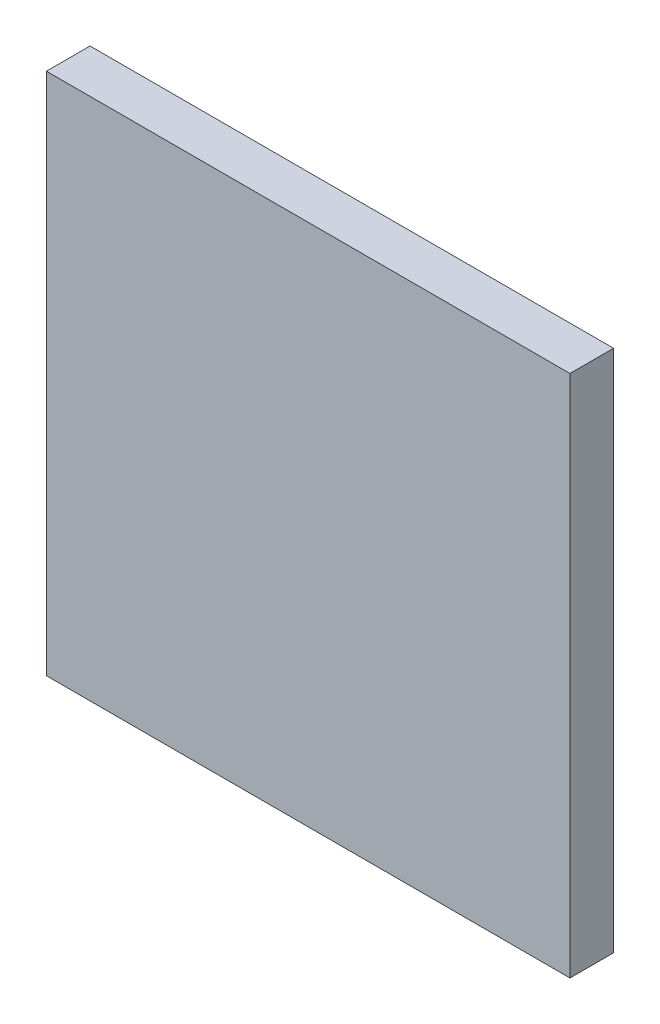
ISO-10303-21;
HEADER;
FILE_DESCRIPTION(('STEP AP214'),'2;1');
FILE_NAME('part.step','',(''),(''),'','','');
FILE_SCHEMA(('AUTOMOTIVE_DESIGN { 1 0 10303 214 1 1 1 1 }'));
ENDSEC;
DATA;
#1=APPLICATION_CONTEXT('core data for automotive mechanical design processes');
#2=APPLICATION_PROTOCOL_DEFINITION('international standard','automotive_design',2000,#1);
#3=PRODUCT_CONTEXT('',#1,'mechanical');
#4=PRODUCT('Part','Part','',(#3));
#5=PRODUCT_RELATED_PRODUCT_CATEGORY('part','',(#4));
#6=PRODUCT_DEFINITION_FORMATION('','',#4);
#7=PRODUCT_DEFINITION_CONTEXT('part definition',#1,'design');
#8=PRODUCT_DEFINITION('design','',#6,#7);
#9=PRODUCT_DEFINITION_SHAPE('','',#8);
#10=(LENGTH_UNIT() NAMED_UNIT(*) SI_UNIT(.MILLI.,.METRE.));
#11=(NAMED_UNIT(*) PLANE_ANGLE_UNIT() SI_UNIT($,.RADIAN.));
#12=(NAMED_UNIT(*) SI_UNIT($,.STERADIAN.) SOLID_ANGLE_UNIT());
#13=UNCERTAINTY_MEASURE_WITH_UNIT(LENGTH_MEASURE(1.E-05),#10,'distance_accuracy_value','');
#14=(GEOMETRIC_REPRESENTATION_CONTEXT(3) GLOBAL_UNCERTAINTY_ASSIGNED_CONTEXT((#13)) GLOBAL_UNIT_ASSIGNED_CONTEXT((#10,
#11,#12)) REPRESENTATION_CONTEXT('',''));
#15=CARTESIAN_POINT('',(0.,0.,0.));
#16=DIRECTION('',(0.,0.,1.));
#17=DIRECTION('',(1.,0.,0.));
#18=AXIS2_PLACEMENT_3D('',#15,#16,#17);
#19=CARTESIAN_POINT('',(-38.1,38.1,6.35));
#20=DIRECTION('',(1.,0.,0.));
#21=DIRECTION('',(0.,0.,-1.));
#22=AXIS2_PLACEMENT_3D('',#19,#20,#21);
#23=PLANE('',#22);
#24=DIRECTION('',(0.,-1.,0.));
#25=VECTOR('',#24,1.);
#26=CARTESIAN_POINT('',(-38.1,38.1,0.));
#27=LINE('',#26,#25);
#28=CARTESIAN_POINT('',(-38.1,38.1,0.));
#29=VERTEX_POINT('',#28);
#30=CARTESIAN_POINT('',(-38.1,-38.1,0.));
#31=VERTEX_POINT('',#30);
#32=EDGE_CURVE('E96',#29,#31,#27,.T.);
#33=ORIENTED_EDGE('',*,*,#32,.T.);
#34=DIRECTION('',(0.,0.,-1.));
#35=VECTOR('',#34,1.);
#36=CARTESIAN_POINT('',(-38.1,-38.1,6.35));
#37=LINE('',#36,#35);
#38=CARTESIAN_POINT('',(-38.1,-38.1,6.35));
#39=VERTEX_POINT('',#38);
#40=EDGE_CURVE('E11',#39,#31,#37,.T.);
#41=ORIENTED_EDGE('',*,*,#40,.F.);
#42=DIRECTION('',(0.,-1.,0.));
#43=VECTOR('',#42,1.);
#44=CARTESIAN_POINT('',(-38.1,38.1,6.35));
#45=LINE('',#44,#43);
#46=CARTESIAN_POINT('',(-38.1,38.1,6.35));
#47=VERTEX_POINT('',#46);
#48=EDGE_CURVE('E84',#47,#39,#45,.T.);
#49=ORIENTED_EDGE('',*,*,#48,.F.);
#50=DIRECTION('',(0.,0.,-1.));
#51=VECTOR('',#50,1.);
#52=CARTESIAN_POINT('',(-38.1,38.1,6.35));
#53=LINE('',#52,#51);
#54=EDGE_CURVE('E92',#47,#29,#53,.T.);
#55=ORIENTED_EDGE('',*,*,#54,.T.);
#56=EDGE_LOOP('',(#33,#41,#49,#55));
#57=FACE_BOUND('',#56,.T.);
#58=ADVANCED_FACE('F33',(#57),#23,.F.);
#59=CARTESIAN_POINT('',(-38.1,-38.1,6.35));
#60=DIRECTION('',(0.,1.,0.));
#61=DIRECTION('',(0.,0.,1.));
#62=AXIS2_PLACEMENT_3D('',#59,#60,#61);
#63=PLANE('',#62);
#64=DIRECTION('',(1.,0.,0.));
#65=VECTOR('',#64,1.);
#66=CARTESIAN_POINT('',(-38.1,-38.1,0.));
#67=LINE('',#66,#65);
#68=CARTESIAN_POINT('',(38.1,-38.1,0.));
#69=VERTEX_POINT('',#68);
#70=EDGE_CURVE('E88',#31,#69,#67,.T.);
#71=ORIENTED_EDGE('',*,*,#70,.T.);
#72=DIRECTION('',(0.,0.,-1.));
#73=VECTOR('',#72,1.);
#74=CARTESIAN_POINT('',(38.1,-38.1,6.35));
#75=LINE('',#74,#73);
#76=CARTESIAN_POINT('',(38.1,-38.1,6.35));
#77=VERTEX_POINT('',#76);
#78=EDGE_CURVE('E41',#77,#69,#75,.T.);
#79=ORIENTED_EDGE('',*,*,#78,.F.);
#80=DIRECTION('',(1.,0.,0.));
#81=VECTOR('',#80,1.);
#82=CARTESIAN_POINT('',(-38.1,-38.1,6.35));
#83=LINE('',#82,#81);
#84=EDGE_CURVE('E79',#39,#77,#83,.T.);
#85=ORIENTED_EDGE('',*,*,#84,.F.);
#86=ORIENTED_EDGE('',*,*,#40,.T.);
#87=EDGE_LOOP('',(#71,#79,#85,#86));
#88=FACE_BOUND('',#87,.T.);
#89=ADVANCED_FACE('F87',(#88),#63,.F.);
#90=CARTESIAN_POINT('',(38.1,38.1,6.35));
#91=DIRECTION('',(-1.,0.,0.));
#92=DIRECTION('',(0.,-1.,0.));
#93=AXIS2_PLACEMENT_3D('',#90,#91,#92);
#94=PLANE('',#93);
#95=DIRECTION('',(0.,1.,0.));
#96=VECTOR('',#95,1.);
#97=CARTESIAN_POINT('',(38.1,38.1,0.));
#98=LINE('',#97,#96);
#99=CARTESIAN_POINT('',(38.1,38.1,0.));
#100=VERTEX_POINT('',#99);
#101=EDGE_CURVE('E66',#69,#100,#98,.T.);
#102=ORIENTED_EDGE('',*,*,#101,.T.);
#103=DIRECTION('',(0.,0.,-1.));
#104=VECTOR('',#103,1.);
#105=CARTESIAN_POINT('',(38.1,38.1,6.35));
#106=LINE('',#105,#104);
#107=CARTESIAN_POINT('',(38.1,38.1,6.35));
#108=VERTEX_POINT('',#107);
#109=EDGE_CURVE('E89',#108,#100,#106,.T.);
#110=ORIENTED_EDGE('',*,*,#109,.F.);
#111=DIRECTION('',(0.,1.,0.));
#112=VECTOR('',#111,1.);
#113=CARTESIAN_POINT('',(38.1,38.1,6.35));
#114=LINE('',#113,#112);
#115=EDGE_CURVE('E82',#77,#108,#114,.T.);
#116=ORIENTED_EDGE('',*,*,#115,.F.);
#117=ORIENTED_EDGE('',*,*,#78,.T.);
#118=EDGE_LOOP('',(#102,#110,#116,#117));
#119=FACE_BOUND('',#118,.T.);
#120=ADVANCED_FACE('F90',(#119),#94,.F.);
#121=CARTESIAN_POINT('',(-38.1,38.1,6.35));
#122=DIRECTION('',(0.,-1.,0.));
#123=DIRECTION('',(0.,0.,-1.));
#124=AXIS2_PLACEMENT_3D('',#121,#122,#123);
#125=PLANE('',#124);
#126=DIRECTION('',(-1.,0.,0.));
#127=VECTOR('',#126,1.);
#128=CARTESIAN_POINT('',(-38.1,38.1,0.));
#129=LINE('',#128,#127);
#130=EDGE_CURVE('E72',#100,#29,#129,.T.);
#131=ORIENTED_EDGE('',*,*,#130,.T.);
#132=ORIENTED_EDGE('',*,*,#54,.F.);
#133=DIRECTION('',(-1.,0.,0.));
#134=VECTOR('',#133,1.);
#135=CARTESIAN_POINT('',(-38.1,38.1,6.35));
#136=LINE('',#135,#134);
#137=EDGE_CURVE('E49',#108,#47,#136,.T.);
#138=ORIENTED_EDGE('',*,*,#137,.F.);
#139=ORIENTED_EDGE('',*,*,#109,.T.);
#140=EDGE_LOOP('',(#131,#132,#138,#139));
#141=FACE_BOUND('',#140,.T.);
#142=ADVANCED_FACE('F103',(#141),#125,.F.);
#143=CARTESIAN_POINT('',(0.,0.,6.35));
#144=DIRECTION('',(0.,0.,1.));
#145=DIRECTION('',(1.,0.,0.));
#146=AXIS2_PLACEMENT_3D('',#143,#144,#145);
#147=PLANE('',#146);
#148=ORIENTED_EDGE('',*,*,#48,.T.);
#149=ORIENTED_EDGE('',*,*,#84,.T.);
#150=ORIENTED_EDGE('',*,*,#115,.T.);
#151=ORIENTED_EDGE('',*,*,#137,.T.);
#152=EDGE_LOOP('',(#148,#149,#150,#151));
#153=FACE_BOUND('',#152,.T.);
#154=ADVANCED_FACE('F80',(#153),#147,.T.);
#155=CARTESIAN_POINT('',(0.,0.,0.));
#156=DIRECTION('',(0.,0.,1.));
#157=DIRECTION('',(1.,0.,0.));
#158=AXIS2_PLACEMENT_3D('',#155,#156,#157);
#159=PLANE('',#158);
#160=ORIENTED_EDGE('',*,*,#32,.F.);
#161=ORIENTED_EDGE('',*,*,#130,.F.);
#162=ORIENTED_EDGE('',*,*,#101,.F.);
#163=ORIENTED_EDGE('',*,*,#70,.F.);
#164=EDGE_LOOP('',(#160,#161,#162,#163));
#165=FACE_BOUND('',#164,.T.);
#166=ADVANCED_FACE('F106',(#165),#159,.F.);
#167=CLOSED_SHELL('',(#58,#89,#120,#142,#154,#166));
#168=MANIFOLD_SOLID_BREP('B2',#167);
#169=ADVANCED_BREP_SHAPE_REPRESENTATION('',(#18,#168),#14);
#170=SHAPE_DEFINITION_REPRESENTATION(#9,#169);
ENDSEC;
END-ISO-10303-21;
